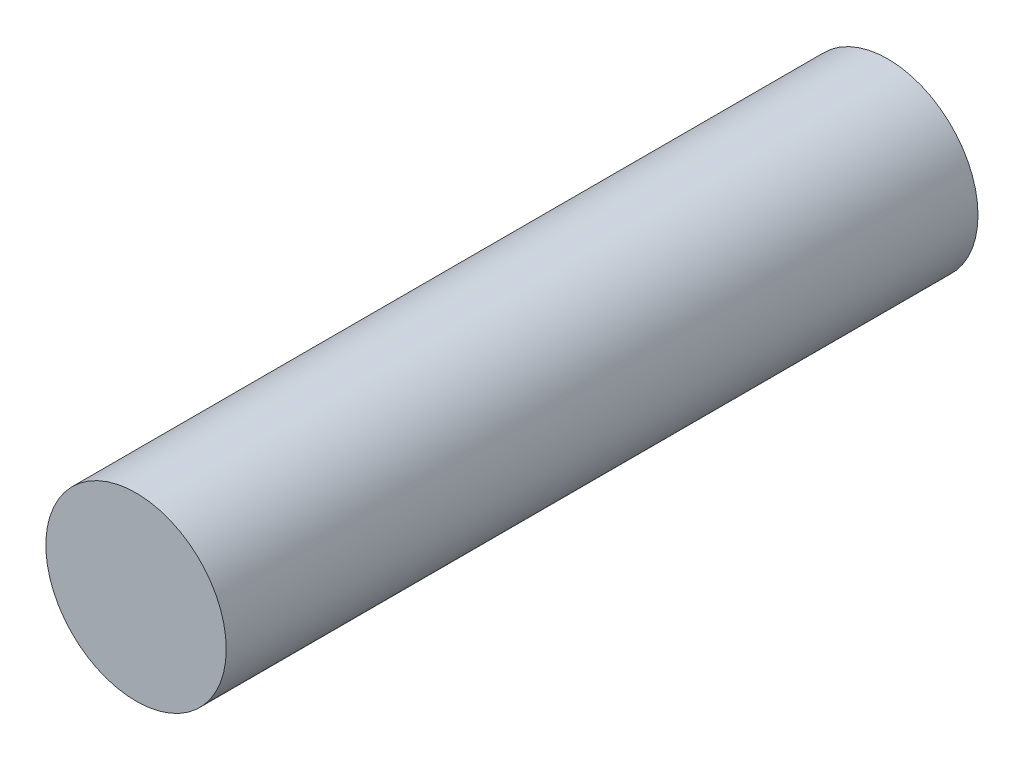
ISO-10303-21;
HEADER;
FILE_DESCRIPTION(('STEP AP214'),'2;1');
FILE_NAME('part.step','',(''),(''),'','','');
FILE_SCHEMA(('AUTOMOTIVE_DESIGN { 1 0 10303 214 1 1 1 1 }'));
ENDSEC;
DATA;
#1=APPLICATION_CONTEXT('core data for automotive mechanical design processes');
#2=APPLICATION_PROTOCOL_DEFINITION('international standard','automotive_design',2000,#1);
#3=PRODUCT_CONTEXT('',#1,'mechanical');
#4=PRODUCT('Part','Part','',(#3));
#5=PRODUCT_RELATED_PRODUCT_CATEGORY('part','',(#4));
#6=PRODUCT_DEFINITION_FORMATION('','',#4);
#7=PRODUCT_DEFINITION_CONTEXT('part definition',#1,'design');
#8=PRODUCT_DEFINITION('design','',#6,#7);
#9=PRODUCT_DEFINITION_SHAPE('','',#8);
#10=(LENGTH_UNIT() NAMED_UNIT(*) SI_UNIT(.MILLI.,.METRE.));
#11=(NAMED_UNIT(*) PLANE_ANGLE_UNIT() SI_UNIT($,.RADIAN.));
#12=(NAMED_UNIT(*) SI_UNIT($,.STERADIAN.) SOLID_ANGLE_UNIT());
#13=UNCERTAINTY_MEASURE_WITH_UNIT(LENGTH_MEASURE(1.E-05),#10,'distance_accuracy_value','');
#14=(GEOMETRIC_REPRESENTATION_CONTEXT(3) GLOBAL_UNCERTAINTY_ASSIGNED_CONTEXT((#13)) GLOBAL_UNIT_ASSIGNED_CONTEXT((#10,
#11,#12)) REPRESENTATION_CONTEXT('',''));
#15=CARTESIAN_POINT('',(0.,0.,0.));
#16=DIRECTION('',(0.,0.,1.));
#17=DIRECTION('',(1.,0.,0.));
#18=AXIS2_PLACEMENT_3D('',#15,#16,#17);
#19=CARTESIAN_POINT('',(0.,0.,50.));
#20=DIRECTION('',(0.,0.,-1.));
#21=DIRECTION('',(-1.,0.,0.));
#22=AXIS2_PLACEMENT_3D('',#19,#20,#21);
#23=CYLINDRICAL_SURFACE('',#22,6.);
#24=CARTESIAN_POINT('',(0.,0.,50.));
#25=DIRECTION('',(0.,0.,1.));
#26=DIRECTION('',(1.,0.,0.));
#27=AXIS2_PLACEMENT_3D('',#24,#25,#26);
#28=CIRCLE('',#27,6.);
#29=CARTESIAN_POINT('',(6.,0.,50.));
#30=VERTEX_POINT('',#29);
#31=EDGE_CURVE('E10',#30,#30,#28,.T.);
#32=ORIENTED_EDGE('',*,*,#31,.F.);
#33=EDGE_LOOP('',(#32));
#34=FACE_BOUND('',#33,.T.);
#35=CARTESIAN_POINT('',(0.,0.,0.));
#36=DIRECTION('',(0.,0.,1.));
#37=DIRECTION('',(1.,0.,0.));
#38=AXIS2_PLACEMENT_3D('',#35,#36,#37);
#39=CIRCLE('',#38,6.);
#40=CARTESIAN_POINT('',(6.,0.,0.));
#41=VERTEX_POINT('',#40);
#42=EDGE_CURVE('E40',#41,#41,#39,.T.);
#43=ORIENTED_EDGE('',*,*,#42,.T.);
#44=EDGE_LOOP('',(#43));
#45=FACE_BOUND('',#44,.T.);
#46=ADVANCED_FACE('F37',(#34,#45),#23,.T.);
#47=CARTESIAN_POINT('',(0.,0.,50.));
#48=DIRECTION('',(0.,0.,1.));
#49=DIRECTION('',(1.,0.,0.));
#50=AXIS2_PLACEMENT_3D('',#47,#48,#49);
#51=PLANE('',#50);
#52=ORIENTED_EDGE('',*,*,#31,.T.);
#53=EDGE_LOOP('',(#52));
#54=FACE_BOUND('',#53,.T.);
#55=ADVANCED_FACE('F54',(#54),#51,.T.);
#56=CARTESIAN_POINT('',(0.,0.,0.));
#57=DIRECTION('',(0.,0.,1.));
#58=DIRECTION('',(1.,0.,0.));
#59=AXIS2_PLACEMENT_3D('',#56,#57,#58);
#60=PLANE('',#59);
#61=ORIENTED_EDGE('',*,*,#42,.F.);
#62=EDGE_LOOP('',(#61));
#63=FACE_BOUND('',#62,.T.);
#64=ADVANCED_FACE('F52',(#63),#60,.F.);
#65=CLOSED_SHELL('',(#46,#55,#64));
#66=MANIFOLD_SOLID_BREP('B2',#65);
#67=ADVANCED_BREP_SHAPE_REPRESENTATION('',(#18,#66),#14);
#68=SHAPE_DEFINITION_REPRESENTATION(#9,#67);
ENDSEC;
END-ISO-10303-21;
